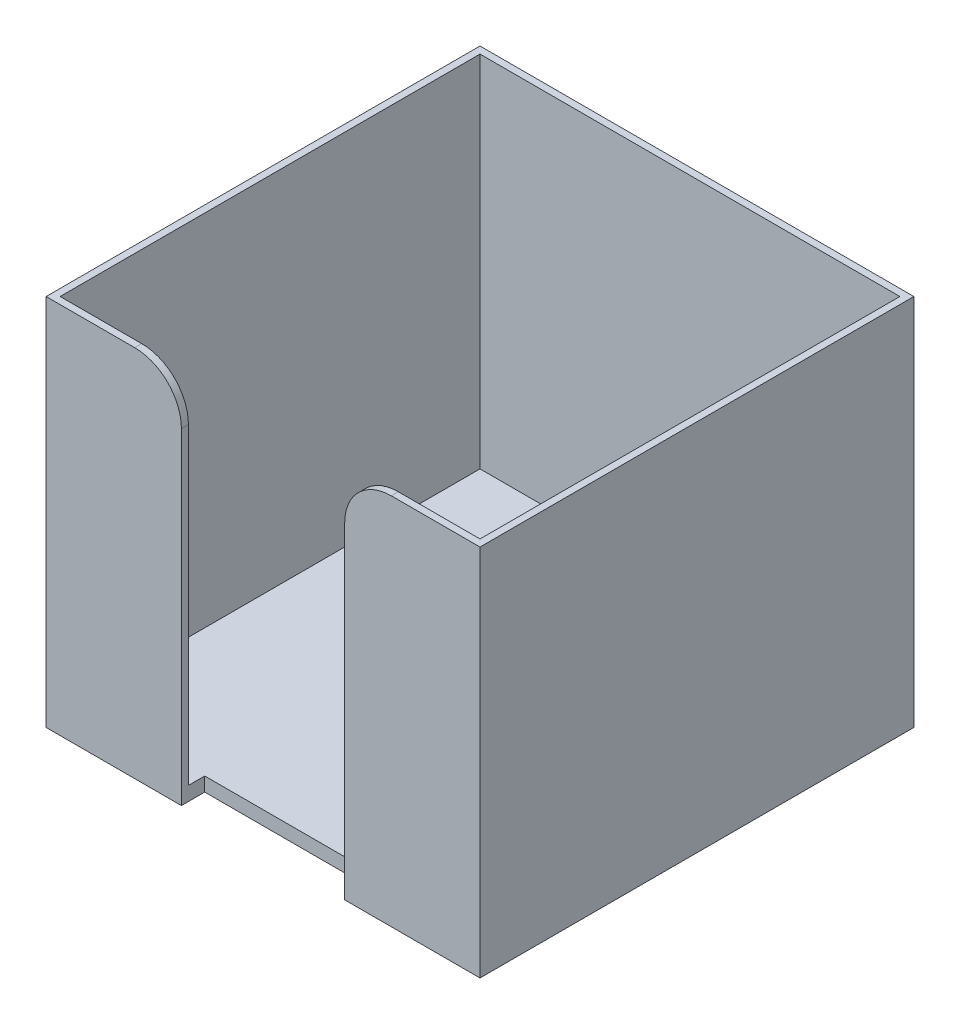
ISO-10303-21;
HEADER;
FILE_DESCRIPTION(('STEP AP214'),'2;1');
FILE_NAME('part.step','',(''),(''),'','','');
FILE_SCHEMA(('AUTOMOTIVE_DESIGN { 1 0 10303 214 1 1 1 1 }'));
ENDSEC;
DATA;
#1=APPLICATION_CONTEXT('core data for automotive mechanical design processes');
#2=APPLICATION_PROTOCOL_DEFINITION('international standard','automotive_design',2000,#1);
#3=PRODUCT_CONTEXT('',#1,'mechanical');
#4=PRODUCT('Part','Part','',(#3));
#5=PRODUCT_RELATED_PRODUCT_CATEGORY('part','',(#4));
#6=PRODUCT_DEFINITION_FORMATION('','',#4);
#7=PRODUCT_DEFINITION_CONTEXT('part definition',#1,'design');
#8=PRODUCT_DEFINITION('design','',#6,#7);
#9=PRODUCT_DEFINITION_SHAPE('','',#8);
#10=(LENGTH_UNIT() NAMED_UNIT(*) SI_UNIT(.MILLI.,.METRE.));
#11=(NAMED_UNIT(*) PLANE_ANGLE_UNIT() SI_UNIT($,.RADIAN.));
#12=(NAMED_UNIT(*) SI_UNIT($,.STERADIAN.) SOLID_ANGLE_UNIT());
#13=UNCERTAINTY_MEASURE_WITH_UNIT(LENGTH_MEASURE(1.E-05),#10,'distance_accuracy_value','');
#14=(GEOMETRIC_REPRESENTATION_CONTEXT(3) GLOBAL_UNCERTAINTY_ASSIGNED_CONTEXT((#13)) GLOBAL_UNIT_ASSIGNED_CONTEXT((#10,
#11,#12)) REPRESENTATION_CONTEXT('',''));
#15=CARTESIAN_POINT('',(0.,0.,0.));
#16=DIRECTION('',(0.,0.,1.));
#17=DIRECTION('',(1.,0.,0.));
#18=AXIS2_PLACEMENT_3D('',#15,#16,#17);
#19=CARTESIAN_POINT('',(-46.5,80.,46.5));
#20=DIRECTION('',(0.,0.,-1.));
#21=DIRECTION('',(-1.,0.,0.));
#22=AXIS2_PLACEMENT_3D('',#19,#20,#21);
#23=PLANE('',#22);
#24=DIRECTION('',(0.,-1.,0.));
#25=VECTOR('',#24,1.);
#26=CARTESIAN_POINT('',(-17.5,80.,46.5));
#27=LINE('',#26,#25);
#28=CARTESIAN_POINT('',(-17.5,70.,46.5));
#29=VERTEX_POINT('',#28);
#30=CARTESIAN_POINT('',(-17.5,0.,46.5));
#31=VERTEX_POINT('',#30);
#32=EDGE_CURVE('E162',#29,#31,#27,.T.);
#33=ORIENTED_EDGE('',*,*,#32,.F.);
#34=CARTESIAN_POINT('',(-27.5,70.,46.5));
#35=DIRECTION('',(0.,0.,-1.));
#36=DIRECTION('',(-1.,0.,0.));
#37=AXIS2_PLACEMENT_3D('',#34,#35,#36);
#38=CIRCLE('',#37,10.);
#39=CARTESIAN_POINT('',(-27.5,80.,46.5));
#40=VERTEX_POINT('',#39);
#41=EDGE_CURVE('E41',#29,#40,#38,.F.);
#42=ORIENTED_EDGE('',*,*,#41,.T.);
#43=DIRECTION('',(1.,0.,0.));
#44=VECTOR('',#43,1.);
#45=CARTESIAN_POINT('',(-46.5,80.,46.5));
#46=LINE('',#45,#44);
#47=CARTESIAN_POINT('',(-46.5,80.,46.5));
#48=VERTEX_POINT('',#47);
#49=EDGE_CURVE('E218',#48,#40,#46,.T.);
#50=ORIENTED_EDGE('',*,*,#49,.F.);
#51=DIRECTION('',(0.,-1.,0.));
#52=VECTOR('',#51,1.);
#53=CARTESIAN_POINT('',(-46.5,80.,46.5));
#54=LINE('',#53,#52);
#55=CARTESIAN_POINT('',(-46.5,0.,46.5));
#56=VERTEX_POINT('',#55);
#57=EDGE_CURVE('E230',#48,#56,#54,.T.);
#58=ORIENTED_EDGE('',*,*,#57,.T.);
#59=DIRECTION('',(1.,0.,0.));
#60=VECTOR('',#59,1.);
#61=CARTESIAN_POINT('',(-46.5,0.,46.5));
#62=LINE('',#61,#60);
#63=EDGE_CURVE('E231',#56,#31,#62,.T.);
#64=ORIENTED_EDGE('',*,*,#63,.T.);
#65=EDGE_LOOP('',(#33,#42,#50,#58,#64));
#66=FACE_BOUND('',#65,.T.);
#67=ADVANCED_FACE('F33',(#66),#23,.F.);
#68=CARTESIAN_POINT('',(-45.,3.,45.));
#69=DIRECTION('',(0.,0.,1.));
#70=DIRECTION('',(1.,0.,0.));
#71=AXIS2_PLACEMENT_3D('',#68,#69,#70);
#72=PLANE('',#71);
#73=DIRECTION('',(1.,0.,0.));
#74=VECTOR('',#73,1.);
#75=CARTESIAN_POINT('',(-45.,80.,45.));
#76=LINE('',#75,#74);
#77=CARTESIAN_POINT('',(-45.,80.,45.));
#78=VERTEX_POINT('',#77);
#79=CARTESIAN_POINT('',(-27.5,80.,45.));
#80=VERTEX_POINT('',#79);
#81=EDGE_CURVE('E188',#78,#80,#76,.T.);
#82=ORIENTED_EDGE('',*,*,#81,.T.);
#83=CARTESIAN_POINT('',(-27.5,70.,45.));
#84=DIRECTION('',(0.,0.,1.));
#85=DIRECTION('',(1.,0.,0.));
#86=AXIS2_PLACEMENT_3D('',#83,#84,#85);
#87=CIRCLE('',#86,10.);
#88=CARTESIAN_POINT('',(-17.5,70.,45.));
#89=VERTEX_POINT('',#88);
#90=EDGE_CURVE('E11',#80,#89,#87,.F.);
#91=ORIENTED_EDGE('',*,*,#90,.T.);
#92=DIRECTION('',(0.,-1.,0.));
#93=VECTOR('',#92,1.);
#94=CARTESIAN_POINT('',(-17.5,3.00000000000001,45.));
#95=LINE('',#94,#93);
#96=CARTESIAN_POINT('',(-17.5,3.,45.));
#97=VERTEX_POINT('',#96);
#98=EDGE_CURVE('E181',#89,#97,#95,.T.);
#99=ORIENTED_EDGE('',*,*,#98,.T.);
#100=DIRECTION('',(1.,0.,0.));
#101=VECTOR('',#100,1.);
#102=CARTESIAN_POINT('',(-45.,3.,45.));
#103=LINE('',#102,#101);
#104=CARTESIAN_POINT('',(-45.,3.,45.));
#105=VERTEX_POINT('',#104);
#106=EDGE_CURVE('E195',#105,#97,#103,.T.);
#107=ORIENTED_EDGE('',*,*,#106,.F.);
#108=DIRECTION('',(0.,1.,0.));
#109=VECTOR('',#108,1.);
#110=CARTESIAN_POINT('',(-45.,3.,45.));
#111=LINE('',#110,#109);
#112=EDGE_CURVE('E212',#105,#78,#111,.T.);
#113=ORIENTED_EDGE('',*,*,#112,.T.);
#114=EDGE_LOOP('',(#82,#91,#99,#107,#113));
#115=FACE_BOUND('',#114,.T.);
#116=ADVANCED_FACE('F278',(#115),#72,.F.);
#117=CARTESIAN_POINT('',(27.5,80.,46.5));
#118=VERTEX_POINT('',#117);
#119=CARTESIAN_POINT('',(46.5,80.,46.5));
#120=VERTEX_POINT('',#119);
#121=EDGE_CURVE('E222',#118,#120,#46,.T.);
#122=ORIENTED_EDGE('',*,*,#121,.F.);
#123=CARTESIAN_POINT('',(27.5,70.,46.5));
#124=DIRECTION('',(0.,0.,-1.));
#125=DIRECTION('',(-1.,0.,0.));
#126=AXIS2_PLACEMENT_3D('',#123,#124,#125);
#127=CIRCLE('',#126,10.);
#128=CARTESIAN_POINT('',(17.5,70.,46.5));
#129=VERTEX_POINT('',#128);
#130=EDGE_CURVE('E261',#118,#129,#127,.F.);
#131=ORIENTED_EDGE('',*,*,#130,.T.);
#132=DIRECTION('',(0.,1.,0.));
#133=VECTOR('',#132,1.);
#134=CARTESIAN_POINT('',(17.5,80.,46.5));
#135=LINE('',#134,#133);
#136=CARTESIAN_POINT('',(17.5,0.,46.5));
#137=VERTEX_POINT('',#136);
#138=EDGE_CURVE('E156',#137,#129,#135,.T.);
#139=ORIENTED_EDGE('',*,*,#138,.F.);
#140=CARTESIAN_POINT('',(46.5,0.,46.5));
#141=VERTEX_POINT('',#140);
#142=EDGE_CURVE('E211',#137,#141,#62,.T.);
#143=ORIENTED_EDGE('',*,*,#142,.T.);
#144=DIRECTION('',(0.,-1.,0.));
#145=VECTOR('',#144,1.);
#146=CARTESIAN_POINT('',(46.5,80.,46.5));
#147=LINE('',#146,#145);
#148=EDGE_CURVE('E247',#120,#141,#147,.T.);
#149=ORIENTED_EDGE('',*,*,#148,.F.);
#150=EDGE_LOOP('',(#122,#131,#139,#143,#149));
#151=FACE_BOUND('',#150,.T.);
#152=ADVANCED_FACE('F305',(#151),#23,.F.);
#153=CARTESIAN_POINT('',(46.5,80.,-46.5));
#154=DIRECTION('',(1.,0.,0.));
#155=DIRECTION('',(0.,0.,-1.));
#156=AXIS2_PLACEMENT_3D('',#153,#154,#155);
#157=PLANE('',#156);
#158=DIRECTION('',(0.,0.,1.));
#159=VECTOR('',#158,1.);
#160=CARTESIAN_POINT('',(46.5,0.,-46.5));
#161=LINE('',#160,#159);
#162=CARTESIAN_POINT('',(46.5,0.,-46.5));
#163=VERTEX_POINT('',#162);
#164=EDGE_CURVE('E233',#163,#141,#161,.T.);
#165=ORIENTED_EDGE('',*,*,#164,.F.);
#166=DIRECTION('',(0.,-1.,0.));
#167=VECTOR('',#166,1.);
#168=CARTESIAN_POINT('',(46.5,80.,-46.5));
#169=LINE('',#168,#167);
#170=CARTESIAN_POINT('',(46.5,80.,-46.5));
#171=VERTEX_POINT('',#170);
#172=EDGE_CURVE('E245',#171,#163,#169,.T.);
#173=ORIENTED_EDGE('',*,*,#172,.F.);
#174=DIRECTION('',(0.,0.,1.));
#175=VECTOR('',#174,1.);
#176=CARTESIAN_POINT('',(46.5,80.,-46.5));
#177=LINE('',#176,#175);
#178=EDGE_CURVE('E221',#171,#120,#177,.T.);
#179=ORIENTED_EDGE('',*,*,#178,.T.);
#180=ORIENTED_EDGE('',*,*,#148,.T.);
#181=EDGE_LOOP('',(#165,#173,#179,#180));
#182=FACE_BOUND('',#181,.T.);
#183=ADVANCED_FACE('F326',(#182),#157,.T.);
#184=CARTESIAN_POINT('',(-46.5,80.,-46.5));
#185=DIRECTION('',(0.,0.,-1.));
#186=DIRECTION('',(-1.,0.,0.));
#187=AXIS2_PLACEMENT_3D('',#184,#185,#186);
#188=PLANE('',#187);
#189=DIRECTION('',(1.,0.,0.));
#190=VECTOR('',#189,1.);
#191=CARTESIAN_POINT('',(-46.5,0.,-46.5));
#192=LINE('',#191,#190);
#193=CARTESIAN_POINT('',(-46.5,0.,-46.5));
#194=VERTEX_POINT('',#193);
#195=EDGE_CURVE('E236',#194,#163,#192,.T.);
#196=ORIENTED_EDGE('',*,*,#195,.F.);
#197=DIRECTION('',(0.,-1.,0.));
#198=VECTOR('',#197,1.);
#199=CARTESIAN_POINT('',(-46.5,80.,-46.5));
#200=LINE('',#199,#198);
#201=CARTESIAN_POINT('',(-46.5,80.,-46.5));
#202=VERTEX_POINT('',#201);
#203=EDGE_CURVE('E243',#202,#194,#200,.T.);
#204=ORIENTED_EDGE('',*,*,#203,.F.);
#205=DIRECTION('',(1.,0.,0.));
#206=VECTOR('',#205,1.);
#207=CARTESIAN_POINT('',(-46.5,80.,-46.5));
#208=LINE('',#207,#206);
#209=EDGE_CURVE('E225',#202,#171,#208,.T.);
#210=ORIENTED_EDGE('',*,*,#209,.T.);
#211=ORIENTED_EDGE('',*,*,#172,.T.);
#212=EDGE_LOOP('',(#196,#204,#210,#211));
#213=FACE_BOUND('',#212,.T.);
#214=ADVANCED_FACE('F330',(#213),#188,.T.);
#215=CARTESIAN_POINT('',(-46.5,80.,-46.5));
#216=DIRECTION('',(1.,0.,0.));
#217=DIRECTION('',(0.,0.,-1.));
#218=AXIS2_PLACEMENT_3D('',#215,#216,#217);
#219=PLANE('',#218);
#220=DIRECTION('',(0.,0.,1.));
#221=VECTOR('',#220,1.);
#222=CARTESIAN_POINT('',(-46.5,0.,-46.5));
#223=LINE('',#222,#221);
#224=EDGE_CURVE('E239',#194,#56,#223,.T.);
#225=ORIENTED_EDGE('',*,*,#224,.T.);
#226=ORIENTED_EDGE('',*,*,#57,.F.);
#227=DIRECTION('',(0.,0.,1.));
#228=VECTOR('',#227,1.);
#229=CARTESIAN_POINT('',(-46.5,80.,-46.5));
#230=LINE('',#229,#228);
#231=EDGE_CURVE('E228',#202,#48,#230,.T.);
#232=ORIENTED_EDGE('',*,*,#231,.F.);
#233=ORIENTED_EDGE('',*,*,#203,.T.);
#234=EDGE_LOOP('',(#225,#226,#232,#233));
#235=FACE_BOUND('',#234,.T.);
#236=ADVANCED_FACE('F335',(#235),#219,.F.);
#237=CARTESIAN_POINT('',(0.,80.,0.));
#238=DIRECTION('',(0.,-1.,0.));
#239=DIRECTION('',(0.,0.,-1.));
#240=AXIS2_PLACEMENT_3D('',#237,#238,#239);
#241=PLANE('',#240);
#242=CARTESIAN_POINT('',(27.5,80.,45.));
#243=VERTEX_POINT('',#242);
#244=CARTESIAN_POINT('',(45.,80.,45.));
#245=VERTEX_POINT('',#244);
#246=EDGE_CURVE('E206',#243,#245,#76,.T.);
#247=ORIENTED_EDGE('',*,*,#246,.F.);
#248=DIRECTION('',(0.,0.,1.));
#249=VECTOR('',#248,1.);
#250=CARTESIAN_POINT('',(27.5,80.,0.));
#251=LINE('',#250,#249);
#252=EDGE_CURVE('E258',#243,#118,#251,.T.);
#253=ORIENTED_EDGE('',*,*,#252,.T.);
#254=ORIENTED_EDGE('',*,*,#121,.T.);
#255=ORIENTED_EDGE('',*,*,#178,.F.);
#256=ORIENTED_EDGE('',*,*,#209,.F.);
#257=ORIENTED_EDGE('',*,*,#231,.T.);
#258=ORIENTED_EDGE('',*,*,#49,.T.);
#259=DIRECTION('',(0.,0.,1.));
#260=VECTOR('',#259,1.);
#261=CARTESIAN_POINT('',(-27.5,80.,0.));
#262=LINE('',#261,#260);
#263=EDGE_CURVE('E256',#40,#80,#262,.F.);
#264=ORIENTED_EDGE('',*,*,#263,.T.);
#265=ORIENTED_EDGE('',*,*,#81,.F.);
#266=DIRECTION('',(0.,0.,1.));
#267=VECTOR('',#266,1.);
#268=CARTESIAN_POINT('',(-45.,80.,-45.));
#269=LINE('',#268,#267);
#270=CARTESIAN_POINT('',(-45.,80.,-45.));
#271=VERTEX_POINT('',#270);
#272=EDGE_CURVE('E203',#271,#78,#269,.T.);
#273=ORIENTED_EDGE('',*,*,#272,.F.);
#274=DIRECTION('',(-1.,0.,0.));
#275=VECTOR('',#274,1.);
#276=CARTESIAN_POINT('',(-45.,80.,-45.));
#277=LINE('',#276,#275);
#278=CARTESIAN_POINT('',(45.,80.,-45.));
#279=VERTEX_POINT('',#278);
#280=EDGE_CURVE('E200',#279,#271,#277,.T.);
#281=ORIENTED_EDGE('',*,*,#280,.F.);
#282=DIRECTION('',(0.,0.,-1.));
#283=VECTOR('',#282,1.);
#284=CARTESIAN_POINT('',(45.,80.,-45.));
#285=LINE('',#284,#283);
#286=EDGE_CURVE('E183',#245,#279,#285,.T.);
#287=ORIENTED_EDGE('',*,*,#286,.F.);
#288=EDGE_LOOP('',(#247,#253,#254,#255,#256,#257,#258,#264,#265,#273,#281,#287));
#289=FACE_BOUND('',#288,.T.);
#290=ADVANCED_FACE('F272',(#289),#241,.F.);
#291=CARTESIAN_POINT('',(0.,0.,0.));
#292=DIRECTION('',(0.,-1.,0.));
#293=DIRECTION('',(0.,0.,-1.));
#294=AXIS2_PLACEMENT_3D('',#291,#292,#293);
#295=PLANE('',#294);
#296=DIRECTION('',(0.,0.,1.));
#297=VECTOR('',#296,1.);
#298=CARTESIAN_POINT('',(-17.5,0.,41.5));
#299=LINE('',#298,#297);
#300=CARTESIAN_POINT('',(-17.5,0.,41.5));
#301=VERTEX_POINT('',#300);
#302=EDGE_CURVE('E159',#301,#31,#299,.T.);
#303=ORIENTED_EDGE('',*,*,#302,.T.);
#304=ORIENTED_EDGE('',*,*,#63,.F.);
#305=ORIENTED_EDGE('',*,*,#224,.F.);
#306=ORIENTED_EDGE('',*,*,#195,.T.);
#307=ORIENTED_EDGE('',*,*,#164,.T.);
#308=ORIENTED_EDGE('',*,*,#142,.F.);
#309=DIRECTION('',(0.,0.,1.));
#310=VECTOR('',#309,1.);
#311=CARTESIAN_POINT('',(17.5,0.,41.5));
#312=LINE('',#311,#310);
#313=CARTESIAN_POINT('',(17.5,0.,41.5));
#314=VERTEX_POINT('',#313);
#315=EDGE_CURVE('E166',#314,#137,#312,.T.);
#316=ORIENTED_EDGE('',*,*,#315,.F.);
#317=DIRECTION('',(1.,0.,0.));
#318=VECTOR('',#317,1.);
#319=CARTESIAN_POINT('',(-17.5,0.,41.5));
#320=LINE('',#319,#318);
#321=EDGE_CURVE('E149',#301,#314,#320,.T.);
#322=ORIENTED_EDGE('',*,*,#321,.F.);
#323=EDGE_LOOP('',(#303,#304,#305,#306,#307,#308,#316,#322));
#324=FACE_BOUND('',#323,.T.);
#325=ADVANCED_FACE('F169',(#324),#295,.T.);
#326=CARTESIAN_POINT('',(45.,3.,-45.));
#327=DIRECTION('',(1.,0.,0.));
#328=DIRECTION('',(0.,0.,-1.));
#329=AXIS2_PLACEMENT_3D('',#326,#327,#328);
#330=PLANE('',#329);
#331=ORIENTED_EDGE('',*,*,#286,.T.);
#332=DIRECTION('',(0.,1.,0.));
#333=VECTOR('',#332,1.);
#334=CARTESIAN_POINT('',(45.,3.,-45.));
#335=LINE('',#334,#333);
#336=CARTESIAN_POINT('',(45.,3.,-45.));
#337=VERTEX_POINT('',#336);
#338=EDGE_CURVE('E198',#337,#279,#335,.T.);
#339=ORIENTED_EDGE('',*,*,#338,.F.);
#340=DIRECTION('',(0.,0.,-1.));
#341=VECTOR('',#340,1.);
#342=CARTESIAN_POINT('',(45.,3.,-45.));
#343=LINE('',#342,#341);
#344=CARTESIAN_POINT('',(45.,3.,45.));
#345=VERTEX_POINT('',#344);
#346=EDGE_CURVE('E184',#345,#337,#343,.T.);
#347=ORIENTED_EDGE('',*,*,#346,.F.);
#348=DIRECTION('',(0.,1.,0.));
#349=VECTOR('',#348,1.);
#350=CARTESIAN_POINT('',(45.,3.,45.));
#351=LINE('',#350,#349);
#352=EDGE_CURVE('E208',#345,#245,#351,.T.);
#353=ORIENTED_EDGE('',*,*,#352,.T.);
#354=EDGE_LOOP('',(#331,#339,#347,#353));
#355=FACE_BOUND('',#354,.T.);
#356=ADVANCED_FACE('F292',(#355),#330,.F.);
#357=DIRECTION('',(0.,1.,0.));
#358=VECTOR('',#357,1.);
#359=CARTESIAN_POINT('',(17.5,3.00000000000001,45.));
#360=LINE('',#359,#358);
#361=CARTESIAN_POINT('',(17.5,3.,45.));
#362=VERTEX_POINT('',#361);
#363=CARTESIAN_POINT('',(17.5,70.,45.));
#364=VERTEX_POINT('',#363);
#365=EDGE_CURVE('E177',#362,#364,#360,.T.);
#366=ORIENTED_EDGE('',*,*,#365,.T.);
#367=CARTESIAN_POINT('',(27.5,70.,45.));
#368=DIRECTION('',(0.,0.,1.));
#369=DIRECTION('',(1.,0.,0.));
#370=AXIS2_PLACEMENT_3D('',#367,#368,#369);
#371=CIRCLE('',#370,10.);
#372=EDGE_CURVE('E265',#364,#243,#371,.F.);
#373=ORIENTED_EDGE('',*,*,#372,.T.);
#374=ORIENTED_EDGE('',*,*,#246,.T.);
#375=ORIENTED_EDGE('',*,*,#352,.F.);
#376=EDGE_CURVE('E194',#362,#345,#103,.T.);
#377=ORIENTED_EDGE('',*,*,#376,.F.);
#378=EDGE_LOOP('',(#366,#373,#374,#375,#377));
#379=FACE_BOUND('',#378,.T.);
#380=ADVANCED_FACE('F296',(#379),#72,.F.);
#381=CARTESIAN_POINT('',(-45.,3.,-45.));
#382=DIRECTION('',(-1.,0.,0.));
#383=DIRECTION('',(0.,0.,1.));
#384=AXIS2_PLACEMENT_3D('',#381,#382,#383);
#385=PLANE('',#384);
#386=ORIENTED_EDGE('',*,*,#272,.T.);
#387=ORIENTED_EDGE('',*,*,#112,.F.);
#388=DIRECTION('',(0.,0.,1.));
#389=VECTOR('',#388,1.);
#390=CARTESIAN_POINT('',(-45.,3.,-45.));
#391=LINE('',#390,#389);
#392=CARTESIAN_POINT('',(-45.,3.,-45.));
#393=VERTEX_POINT('',#392);
#394=EDGE_CURVE('E191',#393,#105,#391,.T.);
#395=ORIENTED_EDGE('',*,*,#394,.F.);
#396=DIRECTION('',(0.,1.,0.));
#397=VECTOR('',#396,1.);
#398=CARTESIAN_POINT('',(-45.,3.,-45.));
#399=LINE('',#398,#397);
#400=EDGE_CURVE('E214',#393,#271,#399,.T.);
#401=ORIENTED_EDGE('',*,*,#400,.T.);
#402=EDGE_LOOP('',(#386,#387,#395,#401));
#403=FACE_BOUND('',#402,.T.);
#404=ADVANCED_FACE('F284',(#403),#385,.F.);
#405=CARTESIAN_POINT('',(-45.,3.,-45.));
#406=DIRECTION('',(0.,0.,-1.));
#407=DIRECTION('',(-1.,0.,0.));
#408=AXIS2_PLACEMENT_3D('',#405,#406,#407);
#409=PLANE('',#408);
#410=ORIENTED_EDGE('',*,*,#280,.T.);
#411=ORIENTED_EDGE('',*,*,#400,.F.);
#412=DIRECTION('',(-1.,0.,0.));
#413=VECTOR('',#412,1.);
#414=CARTESIAN_POINT('',(-45.,3.,-45.));
#415=LINE('',#414,#413);
#416=EDGE_CURVE('E187',#337,#393,#415,.T.);
#417=ORIENTED_EDGE('',*,*,#416,.F.);
#418=ORIENTED_EDGE('',*,*,#338,.T.);
#419=EDGE_LOOP('',(#410,#411,#417,#418));
#420=FACE_BOUND('',#419,.T.);
#421=ADVANCED_FACE('F289',(#420),#409,.F.);
#422=CARTESIAN_POINT('',(0.,3.,0.));
#423=DIRECTION('',(0.,1.,0.));
#424=DIRECTION('',(0.,0.,1.));
#425=AXIS2_PLACEMENT_3D('',#422,#423,#424);
#426=PLANE('',#425);
#427=DIRECTION('',(0.,0.,1.));
#428=VECTOR('',#427,1.);
#429=CARTESIAN_POINT('',(-17.5,3.,0.));
#430=LINE('',#429,#428);
#431=CARTESIAN_POINT('',(-17.5,3.,41.5));
#432=VERTEX_POINT('',#431);
#433=EDGE_CURVE('E254',#432,#97,#430,.T.);
#434=ORIENTED_EDGE('',*,*,#433,.F.);
#435=DIRECTION('',(1.,0.,0.));
#436=VECTOR('',#435,1.);
#437=CARTESIAN_POINT('',(0.,3.,41.5));
#438=LINE('',#437,#436);
#439=CARTESIAN_POINT('',(17.5,3.,41.5));
#440=VERTEX_POINT('',#439);
#441=EDGE_CURVE('E152',#432,#440,#438,.T.);
#442=ORIENTED_EDGE('',*,*,#441,.T.);
#443=DIRECTION('',(0.,0.,-1.));
#444=VECTOR('',#443,1.);
#445=CARTESIAN_POINT('',(17.5,3.,0.));
#446=LINE('',#445,#444);
#447=EDGE_CURVE('E251',#362,#440,#446,.T.);
#448=ORIENTED_EDGE('',*,*,#447,.F.);
#449=ORIENTED_EDGE('',*,*,#376,.T.);
#450=ORIENTED_EDGE('',*,*,#346,.T.);
#451=ORIENTED_EDGE('',*,*,#416,.T.);
#452=ORIENTED_EDGE('',*,*,#394,.T.);
#453=ORIENTED_EDGE('',*,*,#106,.T.);
#454=EDGE_LOOP('',(#434,#442,#448,#449,#450,#451,#452,#453));
#455=FACE_BOUND('',#454,.T.);
#456=ADVANCED_FACE('F280',(#455),#426,.T.);
#457=CARTESIAN_POINT('',(-17.5,80.,41.5));
#458=DIRECTION('',(-1.,0.,0.));
#459=DIRECTION('',(0.,-1.,0.));
#460=AXIS2_PLACEMENT_3D('',#457,#458,#459);
#461=PLANE('',#460);
#462=ORIENTED_EDGE('',*,*,#98,.F.);
#463=DIRECTION('',(0.,0.,1.));
#464=VECTOR('',#463,1.);
#465=CARTESIAN_POINT('',(-17.5,70.,41.5));
#466=LINE('',#465,#464);
#467=EDGE_CURVE('E267',#89,#29,#466,.T.);
#468=ORIENTED_EDGE('',*,*,#467,.T.);
#469=ORIENTED_EDGE('',*,*,#32,.T.);
#470=ORIENTED_EDGE('',*,*,#302,.F.);
#471=DIRECTION('',(0.,-1.,0.));
#472=VECTOR('',#471,1.);
#473=CARTESIAN_POINT('',(-17.5,80.,41.5));
#474=LINE('',#473,#472);
#475=EDGE_CURVE('E145',#432,#301,#474,.T.);
#476=ORIENTED_EDGE('',*,*,#475,.F.);
#477=ORIENTED_EDGE('',*,*,#433,.T.);
#478=EDGE_LOOP('',(#462,#468,#469,#470,#476,#477));
#479=FACE_BOUND('',#478,.T.);
#480=ADVANCED_FACE('F160',(#479),#461,.F.);
#481=CARTESIAN_POINT('',(17.5,80.,41.5));
#482=DIRECTION('',(1.,0.,0.));
#483=DIRECTION('',(0.,1.,0.));
#484=AXIS2_PLACEMENT_3D('',#481,#482,#483);
#485=PLANE('',#484);
#486=ORIENTED_EDGE('',*,*,#138,.T.);
#487=DIRECTION('',(0.,0.,1.));
#488=VECTOR('',#487,1.);
#489=CARTESIAN_POINT('',(17.5,70.,41.5));
#490=LINE('',#489,#488);
#491=EDGE_CURVE('E263',#129,#364,#490,.F.);
#492=ORIENTED_EDGE('',*,*,#491,.T.);
#493=ORIENTED_EDGE('',*,*,#365,.F.);
#494=ORIENTED_EDGE('',*,*,#447,.T.);
#495=DIRECTION('',(0.,1.,0.));
#496=VECTOR('',#495,1.);
#497=CARTESIAN_POINT('',(17.5,80.,41.5));
#498=LINE('',#497,#496);
#499=EDGE_CURVE('E167',#314,#440,#498,.T.);
#500=ORIENTED_EDGE('',*,*,#499,.F.);
#501=ORIENTED_EDGE('',*,*,#315,.T.);
#502=EDGE_LOOP('',(#486,#492,#493,#494,#500,#501));
#503=FACE_BOUND('',#502,.T.);
#504=ADVANCED_FACE('F308',(#503),#485,.F.);
#505=CARTESIAN_POINT('',(0.,0.,41.5));
#506=DIRECTION('',(0.,0.,1.));
#507=DIRECTION('',(1.,0.,0.));
#508=AXIS2_PLACEMENT_3D('',#505,#506,#507);
#509=PLANE('',#508);
#510=ORIENTED_EDGE('',*,*,#475,.T.);
#511=ORIENTED_EDGE('',*,*,#321,.T.);
#512=ORIENTED_EDGE('',*,*,#499,.T.);
#513=ORIENTED_EDGE('',*,*,#441,.F.);
#514=EDGE_LOOP('',(#510,#511,#512,#513));
#515=FACE_BOUND('',#514,.T.);
#516=ADVANCED_FACE('F147',(#515),#509,.T.);
#517=CARTESIAN_POINT('',(27.5,70.,0.));
#518=DIRECTION('',(0.,0.,1.));
#519=DIRECTION('',(1.,0.,0.));
#520=AXIS2_PLACEMENT_3D('',#517,#518,#519);
#521=CYLINDRICAL_SURFACE('',#520,10.);
#522=ORIENTED_EDGE('',*,*,#372,.F.);
#523=ORIENTED_EDGE('',*,*,#491,.F.);
#524=ORIENTED_EDGE('',*,*,#130,.F.);
#525=ORIENTED_EDGE('',*,*,#252,.F.);
#526=EDGE_LOOP('',(#522,#523,#524,#525));
#527=FACE_BOUND('',#526,.T.);
#528=ADVANCED_FACE('F301',(#527),#521,.T.);
#529=CARTESIAN_POINT('',(-27.5,70.,41.5));
#530=DIRECTION('',(0.,0.,1.));
#531=DIRECTION('',(1.,0.,0.));
#532=AXIS2_PLACEMENT_3D('',#529,#530,#531);
#533=CYLINDRICAL_SURFACE('',#532,10.);
#534=ORIENTED_EDGE('',*,*,#90,.F.);
#535=ORIENTED_EDGE('',*,*,#263,.F.);
#536=ORIENTED_EDGE('',*,*,#41,.F.);
#537=ORIENTED_EDGE('',*,*,#467,.F.);
#538=EDGE_LOOP('',(#534,#535,#536,#537));
#539=FACE_BOUND('',#538,.T.);
#540=ADVANCED_FACE('F35',(#539),#533,.T.);
#541=CLOSED_SHELL('',(#67,#116,#152,#183,#214,#236,#290,#325,#356,#380,#404,#421,#456,#480,#504,
#516,#528,#540));
#542=MANIFOLD_SOLID_BREP('B2',#541);
#543=ADVANCED_BREP_SHAPE_REPRESENTATION('',(#18,#542),#14);
#544=SHAPE_DEFINITION_REPRESENTATION(#9,#543);
ENDSEC;
END-ISO-10303-21;
